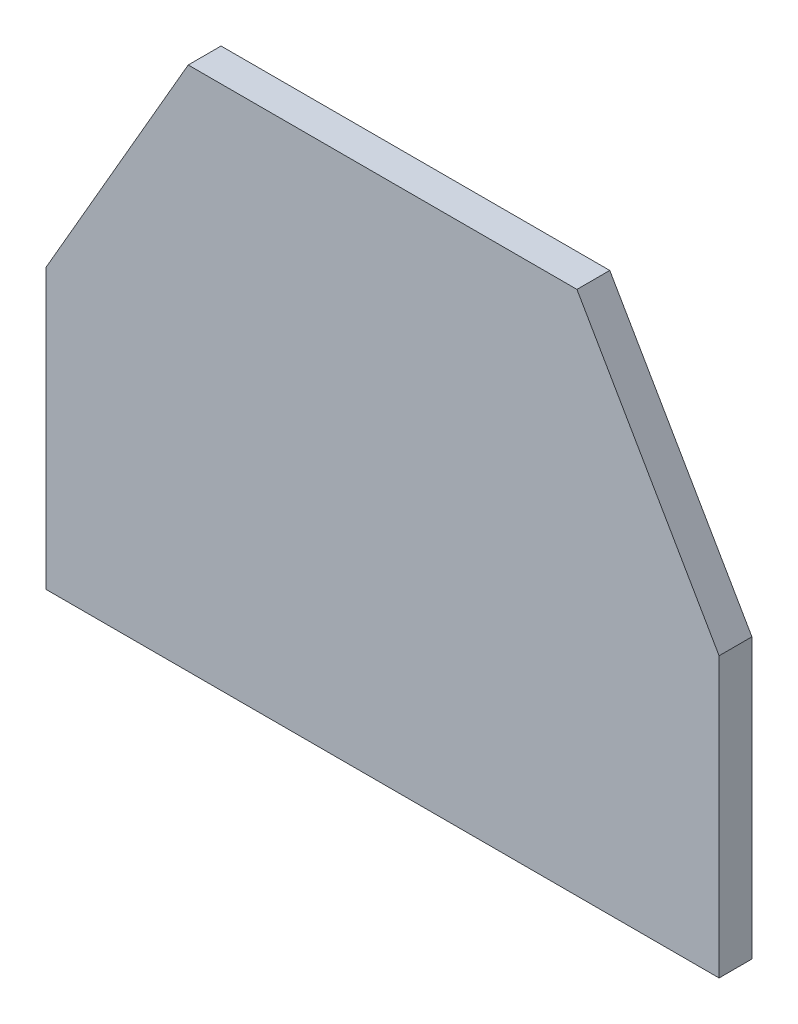
ISO-10303-21;
HEADER;
FILE_DESCRIPTION(('STEP AP214'),'2;1');
FILE_NAME('part.step','',(''),(''),'','','');
FILE_SCHEMA(('AUTOMOTIVE_DESIGN { 1 0 10303 214 1 1 1 1 }'));
ENDSEC;
DATA;
#1=APPLICATION_CONTEXT('core data for automotive mechanical design processes');
#2=APPLICATION_PROTOCOL_DEFINITION('international standard','automotive_design',2000,#1);
#3=PRODUCT_CONTEXT('',#1,'mechanical');
#4=PRODUCT('Part','Part','',(#3));
#5=PRODUCT_RELATED_PRODUCT_CATEGORY('part','',(#4));
#6=PRODUCT_DEFINITION_FORMATION('','',#4);
#7=PRODUCT_DEFINITION_CONTEXT('part definition',#1,'design');
#8=PRODUCT_DEFINITION('design','',#6,#7);
#9=PRODUCT_DEFINITION_SHAPE('','',#8);
#10=(LENGTH_UNIT() NAMED_UNIT(*) SI_UNIT(.MILLI.,.METRE.));
#11=(NAMED_UNIT(*) PLANE_ANGLE_UNIT() SI_UNIT($,.RADIAN.));
#12=(NAMED_UNIT(*) SI_UNIT($,.STERADIAN.) SOLID_ANGLE_UNIT());
#13=UNCERTAINTY_MEASURE_WITH_UNIT(LENGTH_MEASURE(1.E-05),#10,'distance_accuracy_value','');
#14=(GEOMETRIC_REPRESENTATION_CONTEXT(3) GLOBAL_UNCERTAINTY_ASSIGNED_CONTEXT((#13)) GLOBAL_UNIT_ASSIGNED_CONTEXT((#10,
#11,#12)) REPRESENTATION_CONTEXT('',''));
#15=CARTESIAN_POINT('',(0.,0.,0.));
#16=DIRECTION('',(0.,0.,1.));
#17=DIRECTION('',(1.,0.,0.));
#18=AXIS2_PLACEMENT_3D('',#15,#16,#17);
#19=CARTESIAN_POINT('',(-12.9896188202629,7.49867992255546,20.));
#20=DIRECTION('',(0.866050808314088,-0.499955995482118,0.));
#21=DIRECTION('',(0.499955995482118,0.866050808314088,0.));
#22=AXIS2_PLACEMENT_3D('',#19,#20,#21);
#23=PLANE('',#22);
#24=DIRECTION('',(-0.499955995482118,-0.866050808314088,0.));
#25=VECTOR('',#24,1.);
#26=CARTESIAN_POINT('',(-12.9896188202629,7.49867992255546,0.));
#27=LINE('',#26,#25);
#28=CARTESIAN_POINT('',(0.,30.,0.));
#29=VERTEX_POINT('',#28);
#30=CARTESIAN_POINT('',(-86.5923784175028,-120.,0.));
#31=VERTEX_POINT('',#30);
#32=EDGE_CURVE('E117',#29,#31,#27,.T.);
#33=ORIENTED_EDGE('',*,*,#32,.T.);
#34=DIRECTION('',(0.,0.,-1.));
#35=VECTOR('',#34,1.);
#36=CARTESIAN_POINT('',(-86.5923784175028,-120.,20.));
#37=LINE('',#36,#35);
#38=CARTESIAN_POINT('',(-86.5923784175028,-120.,20.));
#39=VERTEX_POINT('',#38);
#40=EDGE_CURVE('E11',#39,#31,#37,.T.);
#41=ORIENTED_EDGE('',*,*,#40,.F.);
#42=DIRECTION('',(-0.499955995482118,-0.866050808314088,0.));
#43=VECTOR('',#42,1.);
#44=CARTESIAN_POINT('',(-12.9896188202629,7.49867992255546,20.));
#45=LINE('',#44,#43);
#46=CARTESIAN_POINT('',(0.,30.,20.));
#47=VERTEX_POINT('',#46);
#48=EDGE_CURVE('E82',#47,#39,#45,.T.);
#49=ORIENTED_EDGE('',*,*,#48,.F.);
#50=DIRECTION('',(0.,0.,-1.));
#51=VECTOR('',#50,1.);
#52=CARTESIAN_POINT('',(0.,30.,20.));
#53=LINE('',#52,#51);
#54=EDGE_CURVE('E51',#47,#29,#53,.T.);
#55=ORIENTED_EDGE('',*,*,#54,.T.);
#56=EDGE_LOOP('',(#33,#41,#49,#55));
#57=FACE_BOUND('',#56,.T.);
#58=ADVANCED_FACE('F35',(#57),#23,.F.);
#59=CARTESIAN_POINT('',(-86.5923784175028,0.,20.));
#60=DIRECTION('',(-1.,0.,0.));
#61=DIRECTION('',(0.,-1.,0.));
#62=AXIS2_PLACEMENT_3D('',#59,#60,#61);
#63=PLANE('',#62);
#64=DIRECTION('',(0.,1.,0.));
#65=VECTOR('',#64,1.);
#66=CARTESIAN_POINT('',(-86.5923784175028,0.,0.));
#67=LINE('',#66,#65);
#68=CARTESIAN_POINT('',(-86.5923784175027,-290.,0.));
#69=VERTEX_POINT('',#68);
#70=EDGE_CURVE('E119',#69,#31,#67,.T.);
#71=ORIENTED_EDGE('',*,*,#70,.F.);
#72=DIRECTION('',(0.,0.,-1.));
#73=VECTOR('',#72,1.);
#74=CARTESIAN_POINT('',(-86.5923784175027,-290.,20.));
#75=LINE('',#74,#73);
#76=CARTESIAN_POINT('',(-86.5923784175027,-290.,20.));
#77=VERTEX_POINT('',#76);
#78=EDGE_CURVE('E43',#77,#69,#75,.T.);
#79=ORIENTED_EDGE('',*,*,#78,.F.);
#80=DIRECTION('',(0.,1.,0.));
#81=VECTOR('',#80,1.);
#82=CARTESIAN_POINT('',(-86.5923784175028,0.,20.));
#83=LINE('',#82,#81);
#84=EDGE_CURVE('E156',#77,#39,#83,.T.);
#85=ORIENTED_EDGE('',*,*,#84,.T.);
#86=ORIENTED_EDGE('',*,*,#40,.T.);
#87=EDGE_LOOP('',(#71,#79,#85,#86));
#88=FACE_BOUND('',#87,.T.);
#89=ADVANCED_FACE('F139',(#88),#63,.T.);
#90=CARTESIAN_POINT('',(0.,-290.,20.));
#91=DIRECTION('',(0.,-1.,0.));
#92=DIRECTION('',(1.,0.,0.));
#93=AXIS2_PLACEMENT_3D('',#90,#91,#92);
#94=PLANE('',#93);
#95=DIRECTION('',(-1.,0.,0.));
#96=VECTOR('',#95,1.);
#97=CARTESIAN_POINT('',(0.,-290.,0.));
#98=LINE('',#97,#96);
#99=CARTESIAN_POINT('',(323.407621582497,-290.,0.));
#100=VERTEX_POINT('',#99);
#101=EDGE_CURVE('E122',#100,#69,#98,.T.);
#102=ORIENTED_EDGE('',*,*,#101,.F.);
#103=DIRECTION('',(0.,0.,-1.));
#104=VECTOR('',#103,1.);
#105=CARTESIAN_POINT('',(323.407621582497,-290.,20.));
#106=LINE('',#105,#104);
#107=CARTESIAN_POINT('',(323.407621582497,-290.,20.));
#108=VERTEX_POINT('',#107);
#109=EDGE_CURVE('E102',#108,#100,#106,.T.);
#110=ORIENTED_EDGE('',*,*,#109,.F.);
#111=DIRECTION('',(-1.,0.,0.));
#112=VECTOR('',#111,1.);
#113=CARTESIAN_POINT('',(0.,-290.,20.));
#114=LINE('',#113,#112);
#115=EDGE_CURVE('E109',#108,#77,#114,.T.);
#116=ORIENTED_EDGE('',*,*,#115,.T.);
#117=ORIENTED_EDGE('',*,*,#78,.T.);
#118=EDGE_LOOP('',(#102,#110,#116,#117));
#119=FACE_BOUND('',#118,.T.);
#120=ADVANCED_FACE('F136',(#119),#94,.T.);
#121=CARTESIAN_POINT('',(323.407621582497,0.,20.));
#122=DIRECTION('',(1.,0.,0.));
#123=DIRECTION('',(0.,0.,-1.));
#124=AXIS2_PLACEMENT_3D('',#121,#122,#123);
#125=PLANE('',#124);
#126=DIRECTION('',(0.,-1.,0.));
#127=VECTOR('',#126,1.);
#128=CARTESIAN_POINT('',(323.407621582497,0.,0.));
#129=LINE('',#128,#127);
#130=CARTESIAN_POINT('',(323.407621582497,-120.,0.));
#131=VERTEX_POINT('',#130);
#132=EDGE_CURVE('E98',#131,#100,#129,.T.);
#133=ORIENTED_EDGE('',*,*,#132,.F.);
#134=DIRECTION('',(0.,0.,-1.));
#135=VECTOR('',#134,1.);
#136=CARTESIAN_POINT('',(323.407621582497,-120.,20.));
#137=LINE('',#136,#135);
#138=CARTESIAN_POINT('',(323.407621582497,-120.,20.));
#139=VERTEX_POINT('',#138);
#140=EDGE_CURVE('E93',#139,#131,#137,.T.);
#141=ORIENTED_EDGE('',*,*,#140,.F.);
#142=DIRECTION('',(0.,-1.,0.));
#143=VECTOR('',#142,1.);
#144=CARTESIAN_POINT('',(323.407621582497,0.,20.));
#145=LINE('',#144,#143);
#146=EDGE_CURVE('E96',#139,#108,#145,.T.);
#147=ORIENTED_EDGE('',*,*,#146,.T.);
#148=ORIENTED_EDGE('',*,*,#109,.T.);
#149=EDGE_LOOP('',(#133,#141,#147,#148));
#150=FACE_BOUND('',#149,.T.);
#151=ADVANCED_FACE('F95',(#150),#125,.T.);
#152=CARTESIAN_POINT('',(190.59851163171,110.038874048707,20.));
#153=DIRECTION('',(0.86603175470726,0.499988999717658,0.));
#154=DIRECTION('',(-0.499988999717658,0.86603175470726,0.));
#155=AXIS2_PLACEMENT_3D('',#152,#153,#154);
#156=PLANE('',#155);
#157=DIRECTION('',(0.499988999717658,-0.86603175470726,0.));
#158=VECTOR('',#157,1.);
#159=CARTESIAN_POINT('',(190.59851163171,110.038874048707,0.));
#160=LINE('',#159,#158);
#161=CARTESIAN_POINT('',(236.807621582497,30.,0.));
#162=VERTEX_POINT('',#161);
#163=EDGE_CURVE('E126',#162,#131,#160,.T.);
#164=ORIENTED_EDGE('',*,*,#163,.F.);
#165=DIRECTION('',(0.,0.,-1.));
#166=VECTOR('',#165,1.);
#167=CARTESIAN_POINT('',(236.807621582497,30.,20.));
#168=LINE('',#167,#166);
#169=CARTESIAN_POINT('',(236.807621582497,30.,20.));
#170=VERTEX_POINT('',#169);
#171=EDGE_CURVE('E70',#170,#162,#168,.T.);
#172=ORIENTED_EDGE('',*,*,#171,.F.);
#173=DIRECTION('',(0.499988999717658,-0.86603175470726,0.));
#174=VECTOR('',#173,1.);
#175=CARTESIAN_POINT('',(190.59851163171,110.038874048707,20.));
#176=LINE('',#175,#174);
#177=EDGE_CURVE('E107',#170,#139,#176,.T.);
#178=ORIENTED_EDGE('',*,*,#177,.T.);
#179=ORIENTED_EDGE('',*,*,#140,.T.);
#180=EDGE_LOOP('',(#164,#172,#178,#179));
#181=FACE_BOUND('',#180,.T.);
#182=ADVANCED_FACE('F111',(#181),#156,.T.);
#183=CARTESIAN_POINT('',(0.,30.,20.));
#184=DIRECTION('',(0.,1.,0.));
#185=DIRECTION('',(-1.,0.,0.));
#186=AXIS2_PLACEMENT_3D('',#183,#184,#185);
#187=PLANE('',#186);
#188=DIRECTION('',(1.,0.,0.));
#189=VECTOR('',#188,1.);
#190=CARTESIAN_POINT('',(0.,30.,0.));
#191=LINE('',#190,#189);
#192=EDGE_CURVE('E128',#29,#162,#191,.T.);
#193=ORIENTED_EDGE('',*,*,#192,.F.);
#194=ORIENTED_EDGE('',*,*,#54,.F.);
#195=DIRECTION('',(1.,0.,0.));
#196=VECTOR('',#195,1.);
#197=CARTESIAN_POINT('',(0.,30.,20.));
#198=LINE('',#197,#196);
#199=EDGE_CURVE('E112',#47,#170,#198,.T.);
#200=ORIENTED_EDGE('',*,*,#199,.T.);
#201=ORIENTED_EDGE('',*,*,#171,.T.);
#202=EDGE_LOOP('',(#193,#194,#200,#201));
#203=FACE_BOUND('',#202,.T.);
#204=ADVANCED_FACE('F142',(#203),#187,.T.);
#205=CARTESIAN_POINT('',(0.,0.,20.));
#206=DIRECTION('',(0.,0.,1.));
#207=DIRECTION('',(1.,0.,0.));
#208=AXIS2_PLACEMENT_3D('',#205,#206,#207);
#209=PLANE('',#208);
#210=ORIENTED_EDGE('',*,*,#48,.T.);
#211=ORIENTED_EDGE('',*,*,#84,.F.);
#212=ORIENTED_EDGE('',*,*,#115,.F.);
#213=ORIENTED_EDGE('',*,*,#146,.F.);
#214=ORIENTED_EDGE('',*,*,#177,.F.);
#215=ORIENTED_EDGE('',*,*,#199,.F.);
#216=EDGE_LOOP('',(#210,#211,#212,#213,#214,#215));
#217=FACE_BOUND('',#216,.T.);
#218=ADVANCED_FACE('F106',(#217),#209,.T.);
#219=CARTESIAN_POINT('',(0.,0.,0.));
#220=DIRECTION('',(0.,0.,1.));
#221=DIRECTION('',(1.,0.,0.));
#222=AXIS2_PLACEMENT_3D('',#219,#220,#221);
#223=PLANE('',#222);
#224=ORIENTED_EDGE('',*,*,#32,.F.);
#225=ORIENTED_EDGE('',*,*,#192,.T.);
#226=ORIENTED_EDGE('',*,*,#163,.T.);
#227=ORIENTED_EDGE('',*,*,#132,.T.);
#228=ORIENTED_EDGE('',*,*,#101,.T.);
#229=ORIENTED_EDGE('',*,*,#70,.T.);
#230=EDGE_LOOP('',(#224,#225,#226,#227,#228,#229));
#231=FACE_BOUND('',#230,.T.);
#232=ADVANCED_FACE('F141',(#231),#223,.F.);
#233=CLOSED_SHELL('',(#58,#89,#120,#151,#182,#204,#218,#232));
#234=MANIFOLD_SOLID_BREP('B2',#233);
#235=ADVANCED_BREP_SHAPE_REPRESENTATION('',(#18,#234),#14);
#236=SHAPE_DEFINITION_REPRESENTATION(#9,#235);
ENDSEC;
END-ISO-10303-21;
